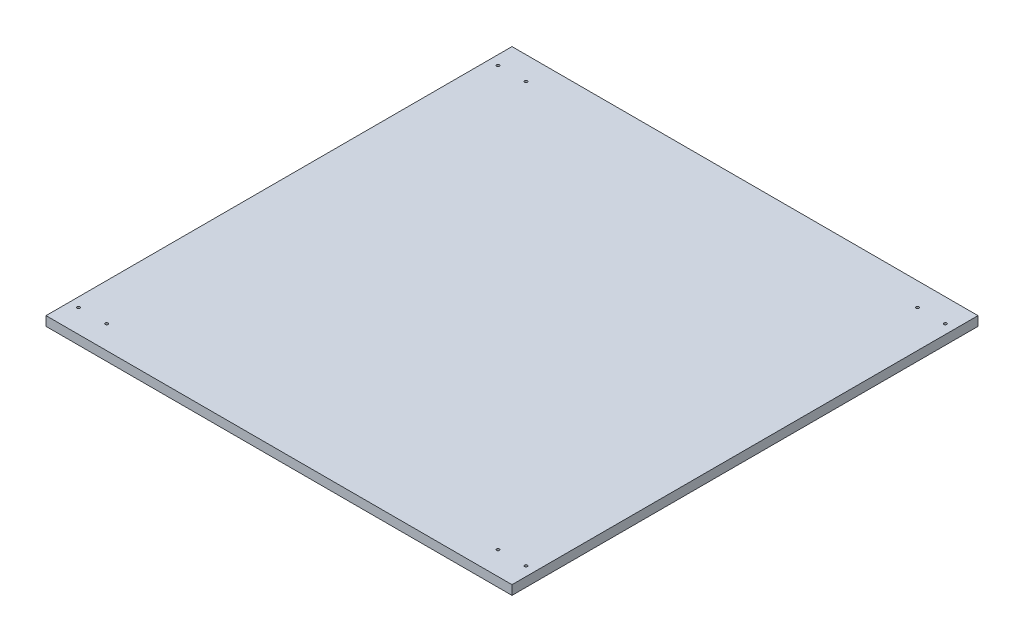
ISO-10303-21;
HEADER;
FILE_DESCRIPTION(('STEP AP214'),'2;1');
FILE_NAME('part.step','',(''),(''),'','','');
FILE_SCHEMA(('AUTOMOTIVE_DESIGN { 1 0 10303 214 1 1 1 1 }'));
ENDSEC;
DATA;
#1=APPLICATION_CONTEXT('core data for automotive mechanical design processes');
#2=APPLICATION_PROTOCOL_DEFINITION('international standard','automotive_design',2000,#1);
#3=PRODUCT_CONTEXT('',#1,'mechanical');
#4=PRODUCT('Part','Part','',(#3));
#5=PRODUCT_RELATED_PRODUCT_CATEGORY('part','',(#4));
#6=PRODUCT_DEFINITION_FORMATION('','',#4);
#7=PRODUCT_DEFINITION_CONTEXT('part definition',#1,'design');
#8=PRODUCT_DEFINITION('design','',#6,#7);
#9=PRODUCT_DEFINITION_SHAPE('','',#8);
#10=(LENGTH_UNIT() NAMED_UNIT(*) SI_UNIT(.MILLI.,.METRE.));
#11=(NAMED_UNIT(*) PLANE_ANGLE_UNIT() SI_UNIT($,.RADIAN.));
#12=(NAMED_UNIT(*) SI_UNIT($,.STERADIAN.) SOLID_ANGLE_UNIT());
#13=UNCERTAINTY_MEASURE_WITH_UNIT(LENGTH_MEASURE(1.E-05),#10,'distance_accuracy_value','');
#14=(GEOMETRIC_REPRESENTATION_CONTEXT(3) GLOBAL_UNCERTAINTY_ASSIGNED_CONTEXT((#13)) GLOBAL_UNIT_ASSIGNED_CONTEXT((#10,
#11,#12)) REPRESENTATION_CONTEXT('',''));
#15=CARTESIAN_POINT('',(0.,0.,0.));
#16=DIRECTION('',(0.,0.,1.));
#17=DIRECTION('',(1.,0.,0.));
#18=AXIS2_PLACEMENT_3D('',#15,#16,#17);
#19=CARTESIAN_POINT('',(0.,10.,-500.));
#20=DIRECTION('',(1.,0.,0.));
#21=DIRECTION('',(0.,0.,-1.));
#22=AXIS2_PLACEMENT_3D('',#19,#20,#21);
#23=PLANE('',#22);
#24=DIRECTION('',(0.,0.,1.));
#25=VECTOR('',#24,1.);
#26=CARTESIAN_POINT('',(0.,0.,-500.));
#27=LINE('',#26,#25);
#28=CARTESIAN_POINT('',(0.,0.,-500.));
#29=VERTEX_POINT('',#28);
#30=CARTESIAN_POINT('',(0.,0.,0.));
#31=VERTEX_POINT('',#30);
#32=EDGE_CURVE('E96',#29,#31,#27,.T.);
#33=ORIENTED_EDGE('',*,*,#32,.T.);
#34=DIRECTION('',(0.,-1.,0.));
#35=VECTOR('',#34,1.);
#36=CARTESIAN_POINT('',(0.,10.,0.));
#37=LINE('',#36,#35);
#38=CARTESIAN_POINT('',(0.,10.,0.));
#39=VERTEX_POINT('',#38);
#40=EDGE_CURVE('E11',#39,#31,#37,.T.);
#41=ORIENTED_EDGE('',*,*,#40,.F.);
#42=DIRECTION('',(0.,0.,1.));
#43=VECTOR('',#42,1.);
#44=CARTESIAN_POINT('',(0.,10.,-500.));
#45=LINE('',#44,#43);
#46=CARTESIAN_POINT('',(0.,10.,-500.));
#47=VERTEX_POINT('',#46);
#48=EDGE_CURVE('E84',#47,#39,#45,.T.);
#49=ORIENTED_EDGE('',*,*,#48,.F.);
#50=DIRECTION('',(0.,-1.,0.));
#51=VECTOR('',#50,1.);
#52=CARTESIAN_POINT('',(0.,10.,-500.));
#53=LINE('',#52,#51);
#54=EDGE_CURVE('E92',#47,#29,#53,.T.);
#55=ORIENTED_EDGE('',*,*,#54,.T.);
#56=EDGE_LOOP('',(#33,#41,#49,#55));
#57=FACE_BOUND('',#56,.T.);
#58=ADVANCED_FACE('F33',(#57),#23,.F.);
#59=CARTESIAN_POINT('',(0.,10.,0.));
#60=DIRECTION('',(0.,0.,-1.));
#61=DIRECTION('',(-1.,0.,0.));
#62=AXIS2_PLACEMENT_3D('',#59,#60,#61);
#63=PLANE('',#62);
#64=DIRECTION('',(1.,0.,0.));
#65=VECTOR('',#64,1.);
#66=CARTESIAN_POINT('',(0.,0.,0.));
#67=LINE('',#66,#65);
#68=CARTESIAN_POINT('',(500.,0.,0.));
#69=VERTEX_POINT('',#68);
#70=EDGE_CURVE('E88',#31,#69,#67,.T.);
#71=ORIENTED_EDGE('',*,*,#70,.T.);
#72=DIRECTION('',(0.,-1.,0.));
#73=VECTOR('',#72,1.);
#74=CARTESIAN_POINT('',(500.,10.,0.));
#75=LINE('',#74,#73);
#76=CARTESIAN_POINT('',(500.,10.,0.));
#77=VERTEX_POINT('',#76);
#78=EDGE_CURVE('E41',#77,#69,#75,.T.);
#79=ORIENTED_EDGE('',*,*,#78,.F.);
#80=DIRECTION('',(1.,0.,0.));
#81=VECTOR('',#80,1.);
#82=CARTESIAN_POINT('',(0.,10.,0.));
#83=LINE('',#82,#81);
#84=EDGE_CURVE('E79',#39,#77,#83,.T.);
#85=ORIENTED_EDGE('',*,*,#84,.F.);
#86=ORIENTED_EDGE('',*,*,#40,.T.);
#87=EDGE_LOOP('',(#71,#79,#85,#86));
#88=FACE_BOUND('',#87,.T.);
#89=ADVANCED_FACE('F87',(#88),#63,.F.);
#90=CARTESIAN_POINT('',(500.,10.,0.));
#91=DIRECTION('',(-1.,0.,0.));
#92=DIRECTION('',(0.,0.,1.));
#93=AXIS2_PLACEMENT_3D('',#90,#91,#92);
#94=PLANE('',#93);
#95=DIRECTION('',(0.,0.,-1.));
#96=VECTOR('',#95,1.);
#97=CARTESIAN_POINT('',(500.,0.,0.));
#98=LINE('',#97,#96);
#99=CARTESIAN_POINT('',(500.,0.,-500.));
#100=VERTEX_POINT('',#99);
#101=EDGE_CURVE('E66',#69,#100,#98,.T.);
#102=ORIENTED_EDGE('',*,*,#101,.T.);
#103=DIRECTION('',(0.,-1.,0.));
#104=VECTOR('',#103,1.);
#105=CARTESIAN_POINT('',(500.,10.,-500.));
#106=LINE('',#105,#104);
#107=CARTESIAN_POINT('',(500.,10.,-500.));
#108=VERTEX_POINT('',#107);
#109=EDGE_CURVE('E89',#108,#100,#106,.T.);
#110=ORIENTED_EDGE('',*,*,#109,.F.);
#111=DIRECTION('',(0.,0.,-1.));
#112=VECTOR('',#111,1.);
#113=CARTESIAN_POINT('',(500.,10.,0.));
#114=LINE('',#113,#112);
#115=EDGE_CURVE('E82',#77,#108,#114,.T.);
#116=ORIENTED_EDGE('',*,*,#115,.F.);
#117=ORIENTED_EDGE('',*,*,#78,.T.);
#118=EDGE_LOOP('',(#102,#110,#116,#117));
#119=FACE_BOUND('',#118,.T.);
#120=ADVANCED_FACE('F90',(#119),#94,.F.);
#121=CARTESIAN_POINT('',(500.,10.,-500.));
#122=DIRECTION('',(0.,0.,1.));
#123=DIRECTION('',(1.,0.,0.));
#124=AXIS2_PLACEMENT_3D('',#121,#122,#123);
#125=PLANE('',#124);
#126=DIRECTION('',(-1.,0.,0.));
#127=VECTOR('',#126,1.);
#128=CARTESIAN_POINT('',(500.,0.,-500.));
#129=LINE('',#128,#127);
#130=EDGE_CURVE('E72',#100,#29,#129,.T.);
#131=ORIENTED_EDGE('',*,*,#130,.T.);
#132=ORIENTED_EDGE('',*,*,#54,.F.);
#133=DIRECTION('',(-1.,0.,0.));
#134=VECTOR('',#133,1.);
#135=CARTESIAN_POINT('',(500.,10.,-500.));
#136=LINE('',#135,#134);
#137=EDGE_CURVE('E49',#108,#47,#136,.T.);
#138=ORIENTED_EDGE('',*,*,#137,.F.);
#139=ORIENTED_EDGE('',*,*,#109,.T.);
#140=EDGE_LOOP('',(#131,#132,#138,#139));
#141=FACE_BOUND('',#140,.T.);
#142=ADVANCED_FACE('F104',(#141),#125,.F.);
#143=CARTESIAN_POINT('',(0.,10.,0.));
#144=DIRECTION('',(0.,1.,0.));
#145=DIRECTION('',(0.,0.,1.));
#146=AXIS2_PLACEMENT_3D('',#143,#144,#145);
#147=PLANE('',#146);
#148=CARTESIAN_POINT('',(490.,10.,-25.));
#149=DIRECTION('',(0.,1.,0.));
#150=DIRECTION('',(0.,0.,1.));
#151=AXIS2_PLACEMENT_3D('',#148,#149,#150);
#152=CIRCLE('',#151,1.50000000000002);
#153=CARTESIAN_POINT('',(490.,10.,-23.5));
#154=VERTEX_POINT('',#153);
#155=EDGE_CURVE('E152',#154,#154,#152,.T.);
#156=ORIENTED_EDGE('',*,*,#155,.F.);
#157=EDGE_LOOP('',(#156));
#158=FACE_BOUND('',#157,.T.);
#159=CARTESIAN_POINT('',(460.,10.,-25.));
#160=DIRECTION('',(0.,1.,0.));
#161=DIRECTION('',(0.,0.,1.));
#162=AXIS2_PLACEMENT_3D('',#159,#160,#161);
#163=CIRCLE('',#162,1.50000000000002);
#164=CARTESIAN_POINT('',(460.,10.,-23.5));
#165=VERTEX_POINT('',#164);
#166=EDGE_CURVE('E146',#165,#165,#163,.T.);
#167=ORIENTED_EDGE('',*,*,#166,.F.);
#168=EDGE_LOOP('',(#167));
#169=FACE_BOUND('',#168,.T.);
#170=CARTESIAN_POINT('',(490.,10.,-475.));
#171=DIRECTION('',(0.,1.,0.));
#172=DIRECTION('',(0.,0.,1.));
#173=AXIS2_PLACEMENT_3D('',#170,#171,#172);
#174=CIRCLE('',#173,1.50000000000002);
#175=CARTESIAN_POINT('',(490.,10.,-473.5));
#176=VERTEX_POINT('',#175);
#177=EDGE_CURVE('E140',#176,#176,#174,.T.);
#178=ORIENTED_EDGE('',*,*,#177,.F.);
#179=EDGE_LOOP('',(#178));
#180=FACE_BOUND('',#179,.T.);
#181=CARTESIAN_POINT('',(460.,10.,-475.));
#182=DIRECTION('',(0.,1.,0.));
#183=DIRECTION('',(0.,0.,1.));
#184=AXIS2_PLACEMENT_3D('',#181,#182,#183);
#185=CIRCLE('',#184,1.50000000000002);
#186=CARTESIAN_POINT('',(460.,10.,-473.5));
#187=VERTEX_POINT('',#186);
#188=EDGE_CURVE('E134',#187,#187,#185,.T.);
#189=ORIENTED_EDGE('',*,*,#188,.F.);
#190=EDGE_LOOP('',(#189));
#191=FACE_BOUND('',#190,.T.);
#192=CARTESIAN_POINT('',(40.,10.,-25.));
#193=DIRECTION('',(0.,1.,0.));
#194=DIRECTION('',(0.,0.,1.));
#195=AXIS2_PLACEMENT_3D('',#192,#193,#194);
#196=CIRCLE('',#195,1.5);
#197=CARTESIAN_POINT('',(40.,10.,-23.5));
#198=VERTEX_POINT('',#197);
#199=EDGE_CURVE('E128',#198,#198,#196,.T.);
#200=ORIENTED_EDGE('',*,*,#199,.F.);
#201=EDGE_LOOP('',(#200));
#202=FACE_BOUND('',#201,.T.);
#203=CARTESIAN_POINT('',(40.,10.,-475.));
#204=DIRECTION('',(0.,1.,0.));
#205=DIRECTION('',(0.,0.,1.));
#206=AXIS2_PLACEMENT_3D('',#203,#204,#205);
#207=CIRCLE('',#206,1.5);
#208=CARTESIAN_POINT('',(40.,10.,-473.5));
#209=VERTEX_POINT('',#208);
#210=EDGE_CURVE('E122',#209,#209,#207,.T.);
#211=ORIENTED_EDGE('',*,*,#210,.F.);
#212=EDGE_LOOP('',(#211));
#213=FACE_BOUND('',#212,.T.);
#214=CARTESIAN_POINT('',(10.,10.,-475.));
#215=DIRECTION('',(0.,1.,0.));
#216=DIRECTION('',(0.,0.,1.));
#217=AXIS2_PLACEMENT_3D('',#214,#215,#216);
#218=CIRCLE('',#217,1.5);
#219=CARTESIAN_POINT('',(10.,10.,-473.5));
#220=VERTEX_POINT('',#219);
#221=EDGE_CURVE('E116',#220,#220,#218,.T.);
#222=ORIENTED_EDGE('',*,*,#221,.F.);
#223=EDGE_LOOP('',(#222));
#224=FACE_BOUND('',#223,.T.);
#225=CARTESIAN_POINT('',(10.,10.,-25.));
#226=DIRECTION('',(0.,1.,0.));
#227=DIRECTION('',(0.,0.,1.));
#228=AXIS2_PLACEMENT_3D('',#225,#226,#227);
#229=CIRCLE('',#228,1.5);
#230=CARTESIAN_POINT('',(10.,10.,-23.5));
#231=VERTEX_POINT('',#230);
#232=EDGE_CURVE('E110',#231,#231,#229,.T.);
#233=ORIENTED_EDGE('',*,*,#232,.F.);
#234=EDGE_LOOP('',(#233));
#235=FACE_BOUND('',#234,.T.);
#236=ORIENTED_EDGE('',*,*,#48,.T.);
#237=ORIENTED_EDGE('',*,*,#84,.T.);
#238=ORIENTED_EDGE('',*,*,#115,.T.);
#239=ORIENTED_EDGE('',*,*,#137,.T.);
#240=EDGE_LOOP('',(#236,#237,#238,#239));
#241=FACE_BOUND('',#240,.T.);
#242=ADVANCED_FACE('F80',(#158,#169,#180,#191,#202,#213,#224,#235,#241),#147,.T.);
#243=CARTESIAN_POINT('',(0.,0.,0.));
#244=DIRECTION('',(0.,1.,0.));
#245=DIRECTION('',(0.,0.,1.));
#246=AXIS2_PLACEMENT_3D('',#243,#244,#245);
#247=PLANE('',#246);
#248=CARTESIAN_POINT('',(490.,0.,-25.));
#249=DIRECTION('',(0.,1.,0.));
#250=DIRECTION('',(0.,0.,1.));
#251=AXIS2_PLACEMENT_3D('',#248,#249,#250);
#252=CIRCLE('',#251,1.50000000000002);
#253=CARTESIAN_POINT('',(490.,0.,-23.5));
#254=VERTEX_POINT('',#253);
#255=EDGE_CURVE('E149',#254,#254,#252,.T.);
#256=ORIENTED_EDGE('',*,*,#255,.T.);
#257=EDGE_LOOP('',(#256));
#258=FACE_BOUND('',#257,.T.);
#259=CARTESIAN_POINT('',(460.,0.,-25.));
#260=DIRECTION('',(0.,1.,0.));
#261=DIRECTION('',(0.,0.,1.));
#262=AXIS2_PLACEMENT_3D('',#259,#260,#261);
#263=CIRCLE('',#262,1.50000000000002);
#264=CARTESIAN_POINT('',(460.,0.,-23.5));
#265=VERTEX_POINT('',#264);
#266=EDGE_CURVE('E143',#265,#265,#263,.T.);
#267=ORIENTED_EDGE('',*,*,#266,.T.);
#268=EDGE_LOOP('',(#267));
#269=FACE_BOUND('',#268,.T.);
#270=CARTESIAN_POINT('',(490.,0.,-475.));
#271=DIRECTION('',(0.,1.,0.));
#272=DIRECTION('',(0.,0.,1.));
#273=AXIS2_PLACEMENT_3D('',#270,#271,#272);
#274=CIRCLE('',#273,1.50000000000002);
#275=CARTESIAN_POINT('',(490.,0.,-473.5));
#276=VERTEX_POINT('',#275);
#277=EDGE_CURVE('E137',#276,#276,#274,.T.);
#278=ORIENTED_EDGE('',*,*,#277,.T.);
#279=EDGE_LOOP('',(#278));
#280=FACE_BOUND('',#279,.T.);
#281=CARTESIAN_POINT('',(460.,0.,-475.));
#282=DIRECTION('',(0.,1.,0.));
#283=DIRECTION('',(0.,0.,1.));
#284=AXIS2_PLACEMENT_3D('',#281,#282,#283);
#285=CIRCLE('',#284,1.50000000000002);
#286=CARTESIAN_POINT('',(460.,0.,-473.5));
#287=VERTEX_POINT('',#286);
#288=EDGE_CURVE('E131',#287,#287,#285,.T.);
#289=ORIENTED_EDGE('',*,*,#288,.T.);
#290=EDGE_LOOP('',(#289));
#291=FACE_BOUND('',#290,.T.);
#292=CARTESIAN_POINT('',(40.,0.,-25.));
#293=DIRECTION('',(0.,1.,0.));
#294=DIRECTION('',(0.,0.,1.));
#295=AXIS2_PLACEMENT_3D('',#292,#293,#294);
#296=CIRCLE('',#295,1.5);
#297=CARTESIAN_POINT('',(40.,0.,-23.5));
#298=VERTEX_POINT('',#297);
#299=EDGE_CURVE('E125',#298,#298,#296,.T.);
#300=ORIENTED_EDGE('',*,*,#299,.T.);
#301=EDGE_LOOP('',(#300));
#302=FACE_BOUND('',#301,.T.);
#303=CARTESIAN_POINT('',(40.,0.,-475.));
#304=DIRECTION('',(0.,1.,0.));
#305=DIRECTION('',(0.,0.,1.));
#306=AXIS2_PLACEMENT_3D('',#303,#304,#305);
#307=CIRCLE('',#306,1.5);
#308=CARTESIAN_POINT('',(40.,0.,-473.5));
#309=VERTEX_POINT('',#308);
#310=EDGE_CURVE('E119',#309,#309,#307,.T.);
#311=ORIENTED_EDGE('',*,*,#310,.T.);
#312=EDGE_LOOP('',(#311));
#313=FACE_BOUND('',#312,.T.);
#314=CARTESIAN_POINT('',(10.,0.,-475.));
#315=DIRECTION('',(0.,1.,0.));
#316=DIRECTION('',(0.,0.,1.));
#317=AXIS2_PLACEMENT_3D('',#314,#315,#316);
#318=CIRCLE('',#317,1.5);
#319=CARTESIAN_POINT('',(10.,0.,-473.5));
#320=VERTEX_POINT('',#319);
#321=EDGE_CURVE('E113',#320,#320,#318,.T.);
#322=ORIENTED_EDGE('',*,*,#321,.T.);
#323=EDGE_LOOP('',(#322));
#324=FACE_BOUND('',#323,.T.);
#325=CARTESIAN_POINT('',(10.,0.,-25.));
#326=DIRECTION('',(0.,1.,0.));
#327=DIRECTION('',(0.,0.,1.));
#328=AXIS2_PLACEMENT_3D('',#325,#326,#327);
#329=CIRCLE('',#328,1.5);
#330=CARTESIAN_POINT('',(10.,0.,-23.5));
#331=VERTEX_POINT('',#330);
#332=EDGE_CURVE('E99',#331,#331,#329,.T.);
#333=ORIENTED_EDGE('',*,*,#332,.T.);
#334=EDGE_LOOP('',(#333));
#335=FACE_BOUND('',#334,.T.);
#336=ORIENTED_EDGE('',*,*,#32,.F.);
#337=ORIENTED_EDGE('',*,*,#130,.F.);
#338=ORIENTED_EDGE('',*,*,#101,.F.);
#339=ORIENTED_EDGE('',*,*,#70,.F.);
#340=EDGE_LOOP('',(#336,#337,#338,#339));
#341=FACE_BOUND('',#340,.T.);
#342=ADVANCED_FACE('F107',(#258,#269,#280,#291,#302,#313,#324,#335,#341),#247,.F.);
#343=CARTESIAN_POINT('',(10.,0.,-25.));
#344=DIRECTION('',(0.,1.,0.));
#345=DIRECTION('',(0.,0.,1.));
#346=AXIS2_PLACEMENT_3D('',#343,#344,#345);
#347=CYLINDRICAL_SURFACE('',#346,1.5);
#348=ORIENTED_EDGE('',*,*,#332,.F.);
#349=EDGE_LOOP('',(#348));
#350=FACE_BOUND('',#349,.T.);
#351=ORIENTED_EDGE('',*,*,#232,.T.);
#352=EDGE_LOOP('',(#351));
#353=FACE_BOUND('',#352,.T.);
#354=ADVANCED_FACE('F184',(#350,#353),#347,.F.);
#355=CARTESIAN_POINT('',(10.,0.,-475.));
#356=DIRECTION('',(0.,1.,0.));
#357=DIRECTION('',(0.,0.,1.));
#358=AXIS2_PLACEMENT_3D('',#355,#356,#357);
#359=CYLINDRICAL_SURFACE('',#358,1.5);
#360=ORIENTED_EDGE('',*,*,#321,.F.);
#361=EDGE_LOOP('',(#360));
#362=FACE_BOUND('',#361,.T.);
#363=ORIENTED_EDGE('',*,*,#221,.T.);
#364=EDGE_LOOP('',(#363));
#365=FACE_BOUND('',#364,.T.);
#366=ADVANCED_FACE('F186',(#362,#365),#359,.F.);
#367=CARTESIAN_POINT('',(40.,0.,-475.));
#368=DIRECTION('',(0.,1.,0.));
#369=DIRECTION('',(0.,0.,1.));
#370=AXIS2_PLACEMENT_3D('',#367,#368,#369);
#371=CYLINDRICAL_SURFACE('',#370,1.5);
#372=ORIENTED_EDGE('',*,*,#310,.F.);
#373=EDGE_LOOP('',(#372));
#374=FACE_BOUND('',#373,.T.);
#375=ORIENTED_EDGE('',*,*,#210,.T.);
#376=EDGE_LOOP('',(#375));
#377=FACE_BOUND('',#376,.T.);
#378=ADVANCED_FACE('F193',(#374,#377),#371,.F.);
#379=CARTESIAN_POINT('',(40.,0.,-25.));
#380=DIRECTION('',(0.,1.,0.));
#381=DIRECTION('',(0.,0.,1.));
#382=AXIS2_PLACEMENT_3D('',#379,#380,#381);
#383=CYLINDRICAL_SURFACE('',#382,1.5);
#384=ORIENTED_EDGE('',*,*,#299,.F.);
#385=EDGE_LOOP('',(#384));
#386=FACE_BOUND('',#385,.T.);
#387=ORIENTED_EDGE('',*,*,#199,.T.);
#388=EDGE_LOOP('',(#387));
#389=FACE_BOUND('',#388,.T.);
#390=ADVANCED_FACE('F239',(#386,#389),#383,.F.);
#391=CARTESIAN_POINT('',(460.,0.,-475.));
#392=DIRECTION('',(0.,1.,0.));
#393=DIRECTION('',(0.,0.,1.));
#394=AXIS2_PLACEMENT_3D('',#391,#392,#393);
#395=CYLINDRICAL_SURFACE('',#394,1.50000000000002);
#396=ORIENTED_EDGE('',*,*,#288,.F.);
#397=EDGE_LOOP('',(#396));
#398=FACE_BOUND('',#397,.T.);
#399=ORIENTED_EDGE('',*,*,#188,.T.);
#400=EDGE_LOOP('',(#399));
#401=FACE_BOUND('',#400,.T.);
#402=ADVANCED_FACE('F249',(#398,#401),#395,.F.);
#403=CARTESIAN_POINT('',(490.,0.,-475.));
#404=DIRECTION('',(0.,1.,0.));
#405=DIRECTION('',(0.,0.,1.));
#406=AXIS2_PLACEMENT_3D('',#403,#404,#405);
#407=CYLINDRICAL_SURFACE('',#406,1.50000000000002);
#408=ORIENTED_EDGE('',*,*,#277,.F.);
#409=EDGE_LOOP('',(#408));
#410=FACE_BOUND('',#409,.T.);
#411=ORIENTED_EDGE('',*,*,#177,.T.);
#412=EDGE_LOOP('',(#411));
#413=FACE_BOUND('',#412,.T.);
#414=ADVANCED_FACE('F259',(#410,#413),#407,.F.);
#415=CARTESIAN_POINT('',(460.,0.,-25.));
#416=DIRECTION('',(0.,1.,0.));
#417=DIRECTION('',(0.,0.,1.));
#418=AXIS2_PLACEMENT_3D('',#415,#416,#417);
#419=CYLINDRICAL_SURFACE('',#418,1.50000000000002);
#420=ORIENTED_EDGE('',*,*,#266,.F.);
#421=EDGE_LOOP('',(#420));
#422=FACE_BOUND('',#421,.T.);
#423=ORIENTED_EDGE('',*,*,#166,.T.);
#424=EDGE_LOOP('',(#423));
#425=FACE_BOUND('',#424,.T.);
#426=ADVANCED_FACE('F163',(#422,#425),#419,.F.);
#427=CARTESIAN_POINT('',(490.,0.,-25.));
#428=DIRECTION('',(0.,1.,0.));
#429=DIRECTION('',(0.,0.,1.));
#430=AXIS2_PLACEMENT_3D('',#427,#428,#429);
#431=CYLINDRICAL_SURFACE('',#430,1.50000000000002);
#432=ORIENTED_EDGE('',*,*,#255,.F.);
#433=EDGE_LOOP('',(#432));
#434=FACE_BOUND('',#433,.T.);
#435=ORIENTED_EDGE('',*,*,#155,.T.);
#436=EDGE_LOOP('',(#435));
#437=FACE_BOUND('',#436,.T.);
#438=ADVANCED_FACE('F160',(#434,#437),#431,.F.);
#439=CLOSED_SHELL('',(#58,#89,#120,#142,#242,#342,#354,#366,#378,#390,#402,#414,#426,#438));
#440=MANIFOLD_SOLID_BREP('B2',#439);
#441=ADVANCED_BREP_SHAPE_REPRESENTATION('',(#18,#440),#14);
#442=SHAPE_DEFINITION_REPRESENTATION(#9,#441);
ENDSEC;
END-ISO-10303-21;
